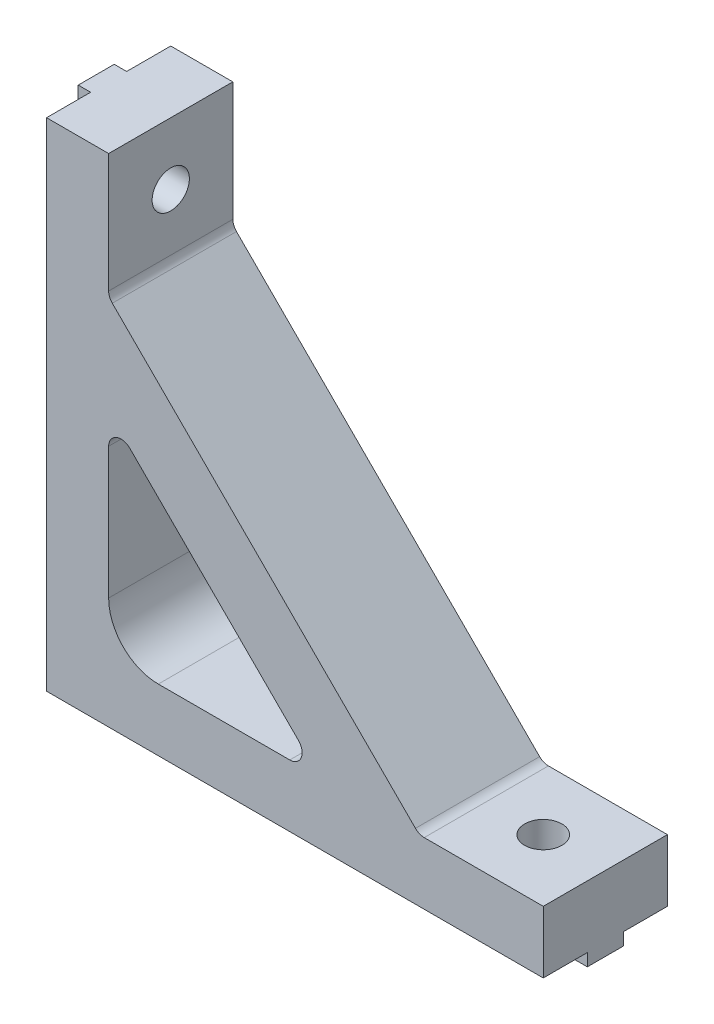
ISO-10303-21;
HEADER;
FILE_DESCRIPTION(('STEP AP214'),'2;1');
FILE_NAME('part.step','',(''),(''),'','','');
FILE_SCHEMA(('AUTOMOTIVE_DESIGN { 1 0 10303 214 1 1 1 1 }'));
ENDSEC;
DATA;
#1=APPLICATION_CONTEXT('core data for automotive mechanical design processes');
#2=APPLICATION_PROTOCOL_DEFINITION('international standard','automotive_design',2000,#1);
#3=PRODUCT_CONTEXT('',#1,'mechanical');
#4=PRODUCT('Part','Part','',(#3));
#5=PRODUCT_RELATED_PRODUCT_CATEGORY('part','',(#4));
#6=PRODUCT_DEFINITION_FORMATION('','',#4);
#7=PRODUCT_DEFINITION_CONTEXT('part definition',#1,'design');
#8=PRODUCT_DEFINITION('design','',#6,#7);
#9=PRODUCT_DEFINITION_SHAPE('','',#8);
#10=(LENGTH_UNIT() NAMED_UNIT(*) SI_UNIT(.MILLI.,.METRE.));
#11=(NAMED_UNIT(*) PLANE_ANGLE_UNIT() SI_UNIT($,.RADIAN.));
#12=(NAMED_UNIT(*) SI_UNIT($,.STERADIAN.) SOLID_ANGLE_UNIT());
#13=UNCERTAINTY_MEASURE_WITH_UNIT(LENGTH_MEASURE(1.E-05),#10,'distance_accuracy_value','');
#14=(GEOMETRIC_REPRESENTATION_CONTEXT(3) GLOBAL_UNCERTAINTY_ASSIGNED_CONTEXT((#13)) GLOBAL_UNIT_ASSIGNED_CONTEXT((#10,
#11,#12)) REPRESENTATION_CONTEXT('',''));
#15=CARTESIAN_POINT('',(0.,0.,0.));
#16=DIRECTION('',(0.,0.,1.));
#17=DIRECTION('',(1.,0.,0.));
#18=AXIS2_PLACEMENT_3D('',#15,#16,#17);
#19=CARTESIAN_POINT('',(40.,5.,10.));
#20=DIRECTION('',(0.,-1.,0.));
#21=DIRECTION('',(1.,0.,0.));
#22=AXIS2_PLACEMENT_3D('',#19,#20,#21);
#23=PLANE('',#22);
#24=CARTESIAN_POINT('',(35.,5.,5.));
#25=DIRECTION('',(0.,-1.,0.));
#26=DIRECTION('',(1.,0.,0.));
#27=AXIS2_PLACEMENT_3D('',#24,#25,#26);
#28=CIRCLE('',#27,1.5);
#29=CARTESIAN_POINT('',(36.5,5.,5.));
#30=VERTEX_POINT('',#29);
#31=EDGE_CURVE('E274',#30,#30,#28,.T.);
#32=ORIENTED_EDGE('',*,*,#31,.T.);
#33=EDGE_LOOP('',(#32));
#34=FACE_BOUND('',#33,.T.);
#35=DIRECTION('',(-1.,0.,0.));
#36=VECTOR('',#35,1.);
#37=CARTESIAN_POINT('',(40.,5.,0.));
#38=LINE('',#37,#36);
#39=CARTESIAN_POINT('',(40.,5.,0.));
#40=VERTEX_POINT('',#39);
#41=CARTESIAN_POINT('',(30.4142135623731,5.,0.));
#42=VERTEX_POINT('',#41);
#43=EDGE_CURVE('E373',#40,#42,#38,.T.);
#44=ORIENTED_EDGE('',*,*,#43,.T.);
#45=DIRECTION('',(0.,0.,1.));
#46=VECTOR('',#45,1.);
#47=CARTESIAN_POINT('',(30.4142135623731,5.,10.));
#48=LINE('',#47,#46);
#49=CARTESIAN_POINT('',(30.4142135623731,5.,10.));
#50=VERTEX_POINT('',#49);
#51=EDGE_CURVE('E429',#42,#50,#48,.T.);
#52=ORIENTED_EDGE('',*,*,#51,.T.);
#53=DIRECTION('',(-1.,0.,0.));
#54=VECTOR('',#53,1.);
#55=CARTESIAN_POINT('',(40.,5.,10.));
#56=LINE('',#55,#54);
#57=CARTESIAN_POINT('',(40.,5.,10.));
#58=VERTEX_POINT('',#57);
#59=EDGE_CURVE('E353',#58,#50,#56,.T.);
#60=ORIENTED_EDGE('',*,*,#59,.F.);
#61=DIRECTION('',(0.,0.,-1.));
#62=VECTOR('',#61,1.);
#63=CARTESIAN_POINT('',(40.,5.,10.));
#64=LINE('',#63,#62);
#65=EDGE_CURVE('E395',#58,#40,#64,.T.);
#66=ORIENTED_EDGE('',*,*,#65,.T.);
#67=EDGE_LOOP('',(#44,#52,#60,#66));
#68=FACE_BOUND('',#67,.T.);
#69=ADVANCED_FACE('F33',(#34,#68),#23,.F.);
#70=CARTESIAN_POINT('',(5.,9.,10.));
#71=DIRECTION('',(-1.,0.,0.));
#72=DIRECTION('',(0.,-1.,0.));
#73=AXIS2_PLACEMENT_3D('',#70,#71,#72);
#74=PLANE('',#73);
#75=CARTESIAN_POINT('',(5.,35.,5.));
#76=DIRECTION('',(-1.,0.,0.));
#77=DIRECTION('',(0.,-1.,0.));
#78=AXIS2_PLACEMENT_3D('',#75,#76,#77);
#79=CIRCLE('',#78,1.5);
#80=CARTESIAN_POINT('',(5.,33.5,5.));
#81=VERTEX_POINT('',#80);
#82=EDGE_CURVE('E308',#81,#81,#79,.T.);
#83=ORIENTED_EDGE('',*,*,#82,.T.);
#84=EDGE_LOOP('',(#83));
#85=FACE_BOUND('',#84,.T.);
#86=DIRECTION('',(0.,1.,0.));
#87=VECTOR('',#86,1.);
#88=CARTESIAN_POINT('',(5.,9.,10.));
#89=LINE('',#88,#87);
#90=CARTESIAN_POINT('',(5.,30.4142135623731,10.));
#91=VERTEX_POINT('',#90);
#92=CARTESIAN_POINT('',(5.,40.,10.));
#93=VERTEX_POINT('',#92);
#94=EDGE_CURVE('E358',#91,#93,#89,.T.);
#95=ORIENTED_EDGE('',*,*,#94,.F.);
#96=DIRECTION('',(0.,0.,1.));
#97=VECTOR('',#96,1.);
#98=CARTESIAN_POINT('',(5.,30.4142135623731,10.));
#99=LINE('',#98,#97);
#100=CARTESIAN_POINT('',(5.,30.4142135623731,0.));
#101=VERTEX_POINT('',#100);
#102=EDGE_CURVE('E427',#91,#101,#99,.F.);
#103=ORIENTED_EDGE('',*,*,#102,.T.);
#104=DIRECTION('',(0.,1.,0.));
#105=VECTOR('',#104,1.);
#106=CARTESIAN_POINT('',(5.,9.,0.));
#107=LINE('',#106,#105);
#108=CARTESIAN_POINT('',(5.,40.,0.));
#109=VERTEX_POINT('',#108);
#110=EDGE_CURVE('E377',#101,#109,#107,.T.);
#111=ORIENTED_EDGE('',*,*,#110,.T.);
#112=DIRECTION('',(0.,0.,-1.));
#113=VECTOR('',#112,1.);
#114=CARTESIAN_POINT('',(5.,40.,10.));
#115=LINE('',#114,#113);
#116=EDGE_CURVE('E386',#93,#109,#115,.T.);
#117=ORIENTED_EDGE('',*,*,#116,.F.);
#118=EDGE_LOOP('',(#95,#103,#111,#117));
#119=FACE_BOUND('',#118,.T.);
#120=ADVANCED_FACE('F530',(#85,#119),#74,.F.);
#121=CARTESIAN_POINT('',(0.,-1.,3.55));
#122=DIRECTION('',(0.,0.,1.));
#123=DIRECTION('',(1.,0.,0.));
#124=AXIS2_PLACEMENT_3D('',#121,#122,#123);
#125=PLANE('',#124);
#126=DIRECTION('',(1.,0.,0.));
#127=VECTOR('',#126,1.);
#128=CARTESIAN_POINT('',(0.,0.,3.55));
#129=LINE('',#128,#127);
#130=CARTESIAN_POINT('',(0.,0.,3.55));
#131=VERTEX_POINT('',#130);
#132=CARTESIAN_POINT('',(34.6159427126065,0.,3.55000000000001));
#133=VERTEX_POINT('',#132);
#134=EDGE_CURVE('E275',#131,#133,#129,.T.);
#135=ORIENTED_EDGE('',*,*,#134,.T.);
#136=DIRECTION('',(0.,-1.,0.));
#137=VECTOR('',#136,1.);
#138=CARTESIAN_POINT('',(34.6159427126065,40.,3.55000000000001));
#139=LINE('',#138,#137);
#140=CARTESIAN_POINT('',(34.6159427126065,-1.,3.55000000000001));
#141=VERTEX_POINT('',#140);
#142=EDGE_CURVE('E600',#133,#141,#139,.T.);
#143=ORIENTED_EDGE('',*,*,#142,.T.);
#144=DIRECTION('',(1.,0.,0.));
#145=VECTOR('',#144,1.);
#146=CARTESIAN_POINT('',(0.,-1.,3.55));
#147=LINE('',#146,#145);
#148=CARTESIAN_POINT('',(0.,-1.,3.55));
#149=VERTEX_POINT('',#148);
#150=EDGE_CURVE('E256',#149,#141,#147,.T.);
#151=ORIENTED_EDGE('',*,*,#150,.F.);
#152=DIRECTION('',(0.,1.,0.));
#153=VECTOR('',#152,1.);
#154=CARTESIAN_POINT('',(0.,-1.,3.55));
#155=LINE('',#154,#153);
#156=EDGE_CURVE('E287',#149,#131,#155,.T.);
#157=ORIENTED_EDGE('',*,*,#156,.T.);
#158=EDGE_LOOP('',(#135,#143,#151,#157));
#159=FACE_BOUND('',#158,.T.);
#160=ADVANCED_FACE('F483',(#159),#125,.F.);
#161=CARTESIAN_POINT('',(0.,-1.,6.45));
#162=DIRECTION('',(0.,0.,-1.));
#163=DIRECTION('',(-1.,0.,0.));
#164=AXIS2_PLACEMENT_3D('',#161,#162,#163);
#165=PLANE('',#164);
#166=DIRECTION('',(-1.,0.,0.));
#167=VECTOR('',#166,1.);
#168=CARTESIAN_POINT('',(0.,0.,6.45));
#169=LINE('',#168,#167);
#170=CARTESIAN_POINT('',(40.,0.,6.45));
#171=VERTEX_POINT('',#170);
#172=CARTESIAN_POINT('',(35.3840572873934,0.,6.45000000000001));
#173=VERTEX_POINT('',#172);
#174=EDGE_CURVE('E262',#171,#173,#169,.T.);
#175=ORIENTED_EDGE('',*,*,#174,.T.);
#176=DIRECTION('',(0.,-1.,0.));
#177=VECTOR('',#176,1.);
#178=CARTESIAN_POINT('',(35.3840572873934,40.,6.45000000000001));
#179=LINE('',#178,#177);
#180=CARTESIAN_POINT('',(35.3840572873934,-1.,6.45000000000001));
#181=VERTEX_POINT('',#180);
#182=EDGE_CURVE('E240',#173,#181,#179,.T.);
#183=ORIENTED_EDGE('',*,*,#182,.T.);
#184=DIRECTION('',(-1.,0.,0.));
#185=VECTOR('',#184,1.);
#186=CARTESIAN_POINT('',(0.,-1.,6.45));
#187=LINE('',#186,#185);
#188=CARTESIAN_POINT('',(40.,-1.,6.45000000000001));
#189=VERTEX_POINT('',#188);
#190=EDGE_CURVE('E248',#189,#181,#187,.T.);
#191=ORIENTED_EDGE('',*,*,#190,.F.);
#192=DIRECTION('',(0.,1.,0.));
#193=VECTOR('',#192,1.);
#194=CARTESIAN_POINT('',(40.,-1.,6.45000000000001));
#195=LINE('',#194,#193);
#196=EDGE_CURVE('E283',#189,#171,#195,.T.);
#197=ORIENTED_EDGE('',*,*,#196,.T.);
#198=EDGE_LOOP('',(#175,#183,#191,#197));
#199=FACE_BOUND('',#198,.T.);
#200=ADVANCED_FACE('F616',(#199),#165,.F.);
#201=CARTESIAN_POINT('',(0.,-1.,0.));
#202=DIRECTION('',(0.,1.,0.));
#203=DIRECTION('',(0.,0.,1.));
#204=AXIS2_PLACEMENT_3D('',#201,#202,#203);
#205=PLANE('',#204);
#206=ORIENTED_EDGE('',*,*,#190,.T.);
#207=CARTESIAN_POINT('',(35.,-1.,5.));
#208=DIRECTION('',(0.,-1.,0.));
#209=DIRECTION('',(0.,0.,-1.));
#210=AXIS2_PLACEMENT_3D('',#207,#208,#209);
#211=CIRCLE('',#210,1.5);
#212=CARTESIAN_POINT('',(35.3840572873935,-1.,3.55000000000001));
#213=VERTEX_POINT('',#212);
#214=EDGE_CURVE('E233',#213,#181,#211,.T.);
#215=ORIENTED_EDGE('',*,*,#214,.F.);
#216=CARTESIAN_POINT('',(40.,-1.,3.55000000000001));
#217=VERTEX_POINT('',#216);
#218=EDGE_CURVE('E245',#213,#217,#147,.T.);
#219=ORIENTED_EDGE('',*,*,#218,.T.);
#220=DIRECTION('',(0.,0.,1.));
#221=VECTOR('',#220,1.);
#222=CARTESIAN_POINT('',(40.,-1.,3.55000000000001));
#223=LINE('',#222,#221);
#224=EDGE_CURVE('E260',#217,#189,#223,.T.);
#225=ORIENTED_EDGE('',*,*,#224,.T.);
#226=EDGE_LOOP('',(#206,#215,#219,#225));
#227=FACE_BOUND('',#226,.T.);
#228=ADVANCED_FACE('F244',(#227),#205,.F.);
#229=CARTESIAN_POINT('',(0.,0.,10.));
#230=DIRECTION('',(0.,1.,0.));
#231=DIRECTION('',(0.,0.,1.));
#232=AXIS2_PLACEMENT_3D('',#229,#230,#231);
#233=PLANE('',#232);
#234=CARTESIAN_POINT('',(34.6159427126066,0.,6.45000000000001));
#235=VERTEX_POINT('',#234);
#236=CARTESIAN_POINT('',(0.,0.,6.45));
#237=VERTEX_POINT('',#236);
#238=EDGE_CURVE('E278',#235,#237,#169,.T.);
#239=ORIENTED_EDGE('',*,*,#238,.F.);
#240=CARTESIAN_POINT('',(35.,0.,5.));
#241=DIRECTION('',(0.,1.,0.));
#242=DIRECTION('',(0.,0.,1.));
#243=AXIS2_PLACEMENT_3D('',#240,#241,#242);
#244=CIRCLE('',#243,1.5);
#245=EDGE_CURVE('E497',#235,#173,#244,.T.);
#246=ORIENTED_EDGE('',*,*,#245,.T.);
#247=ORIENTED_EDGE('',*,*,#174,.F.);
#248=DIRECTION('',(0.,0.,-1.));
#249=VECTOR('',#248,1.);
#250=CARTESIAN_POINT('',(40.,0.,10.));
#251=LINE('',#250,#249);
#252=CARTESIAN_POINT('',(40.,0.,10.));
#253=VERTEX_POINT('',#252);
#254=EDGE_CURVE('E399',#253,#171,#251,.T.);
#255=ORIENTED_EDGE('',*,*,#254,.F.);
#256=DIRECTION('',(1.,0.,0.));
#257=VECTOR('',#256,1.);
#258=CARTESIAN_POINT('',(0.,0.,10.));
#259=LINE('',#258,#257);
#260=CARTESIAN_POINT('',(0.,0.,10.));
#261=VERTEX_POINT('',#260);
#262=EDGE_CURVE('E347',#261,#253,#259,.T.);
#263=ORIENTED_EDGE('',*,*,#262,.F.);
#264=DIRECTION('',(0.,0.,-1.));
#265=VECTOR('',#264,1.);
#266=CARTESIAN_POINT('',(0.,0.,10.));
#267=LINE('',#266,#265);
#268=EDGE_CURVE('E403',#261,#237,#267,.T.);
#269=ORIENTED_EDGE('',*,*,#268,.T.);
#270=EDGE_LOOP('',(#239,#246,#247,#255,#263,#269));
#271=FACE_BOUND('',#270,.T.);
#272=ADVANCED_FACE('F496',(#271),#233,.F.);
#273=DIRECTION('',(0.,0.,-1.));
#274=VECTOR('',#273,1.);
#275=CARTESIAN_POINT('',(0.,0.,3.55));
#276=LINE('',#275,#274);
#277=EDGE_CURVE('E270',#237,#131,#276,.T.);
#278=ORIENTED_EDGE('',*,*,#277,.F.);
#279=DIRECTION('',(1.,0.,0.));
#280=VECTOR('',#279,1.);
#281=CARTESIAN_POINT('',(-1.,0.,6.45000000000001));
#282=LINE('',#281,#280);
#283=CARTESIAN_POINT('',(-1.,0.,6.45000000000001));
#284=VERTEX_POINT('',#283);
#285=EDGE_CURVE('E337',#284,#237,#282,.T.);
#286=ORIENTED_EDGE('',*,*,#285,.F.);
#287=DIRECTION('',(0.,0.,1.));
#288=VECTOR('',#287,1.);
#289=CARTESIAN_POINT('',(-1.,0.,3.55));
#290=LINE('',#289,#288);
#291=CARTESIAN_POINT('',(-1.,0.,3.55));
#292=VERTEX_POINT('',#291);
#293=EDGE_CURVE('E315',#292,#284,#290,.T.);
#294=ORIENTED_EDGE('',*,*,#293,.F.);
#295=DIRECTION('',(1.,0.,0.));
#296=VECTOR('',#295,1.);
#297=CARTESIAN_POINT('',(-1.,0.,3.55));
#298=LINE('',#297,#296);
#299=EDGE_CURVE('E340',#292,#131,#298,.T.);
#300=ORIENTED_EDGE('',*,*,#299,.T.);
#301=EDGE_LOOP('',(#278,#286,#294,#300));
#302=FACE_BOUND('',#301,.T.);
#303=ADVANCED_FACE('F476',(#302),#233,.F.);
#304=CARTESIAN_POINT('',(35.3840572873935,0.,3.55000000000001));
#305=VERTEX_POINT('',#304);
#306=CARTESIAN_POINT('',(40.,0.,3.55000000000001));
#307=VERTEX_POINT('',#306);
#308=EDGE_CURVE('E273',#305,#307,#129,.T.);
#309=ORIENTED_EDGE('',*,*,#308,.F.);
#310=CARTESIAN_POINT('',(35.,0.,5.));
#311=DIRECTION('',(0.,1.,0.));
#312=DIRECTION('',(0.,0.,1.));
#313=AXIS2_PLACEMENT_3D('',#310,#311,#312);
#314=CIRCLE('',#313,1.5);
#315=EDGE_CURVE('E236',#305,#133,#314,.T.);
#316=ORIENTED_EDGE('',*,*,#315,.T.);
#317=ORIENTED_EDGE('',*,*,#134,.F.);
#318=CARTESIAN_POINT('',(0.,0.,0.));
#319=VERTEX_POINT('',#318);
#320=EDGE_CURVE('E402',#131,#319,#267,.T.);
#321=ORIENTED_EDGE('',*,*,#320,.T.);
#322=DIRECTION('',(1.,0.,0.));
#323=VECTOR('',#322,1.);
#324=CARTESIAN_POINT('',(0.,0.,0.));
#325=LINE('',#324,#323);
#326=CARTESIAN_POINT('',(40.,0.,0.));
#327=VERTEX_POINT('',#326);
#328=EDGE_CURVE('E367',#319,#327,#325,.T.);
#329=ORIENTED_EDGE('',*,*,#328,.T.);
#330=EDGE_CURVE('E398',#307,#327,#251,.T.);
#331=ORIENTED_EDGE('',*,*,#330,.F.);
#332=EDGE_LOOP('',(#309,#316,#317,#321,#329,#331));
#333=FACE_BOUND('',#332,.T.);
#334=ADVANCED_FACE('F466',(#333),#233,.F.);
#335=CARTESIAN_POINT('',(-1.,40.,3.55));
#336=DIRECTION('',(0.,0.,1.));
#337=DIRECTION('',(0.,-1.,0.));
#338=AXIS2_PLACEMENT_3D('',#335,#336,#337);
#339=PLANE('',#338);
#340=DIRECTION('',(0.,-1.,0.));
#341=VECTOR('',#340,1.);
#342=CARTESIAN_POINT('',(0.,40.,3.55));
#343=LINE('',#342,#341);
#344=CARTESIAN_POINT('',(0.,40.,3.55));
#345=VERTEX_POINT('',#344);
#346=CARTESIAN_POINT('',(0.,35.3840572873935,3.55));
#347=VERTEX_POINT('',#346);
#348=EDGE_CURVE('E325',#345,#347,#343,.T.);
#349=ORIENTED_EDGE('',*,*,#348,.T.);
#350=DIRECTION('',(-1.,0.,0.));
#351=VECTOR('',#350,1.);
#352=CARTESIAN_POINT('',(40.,35.3840572873934,3.55));
#353=LINE('',#352,#351);
#354=CARTESIAN_POINT('',(-1.,35.3840572873935,3.55));
#355=VERTEX_POINT('',#354);
#356=EDGE_CURVE('E305',#347,#355,#353,.T.);
#357=ORIENTED_EDGE('',*,*,#356,.T.);
#358=DIRECTION('',(0.,-1.,0.));
#359=VECTOR('',#358,1.);
#360=CARTESIAN_POINT('',(-1.,40.,3.55));
#361=LINE('',#360,#359);
#362=CARTESIAN_POINT('',(-1.,40.,3.55));
#363=VERTEX_POINT('',#362);
#364=EDGE_CURVE('E312',#363,#355,#361,.T.);
#365=ORIENTED_EDGE('',*,*,#364,.F.);
#366=DIRECTION('',(1.,0.,0.));
#367=VECTOR('',#366,1.);
#368=CARTESIAN_POINT('',(-1.,40.,3.55));
#369=LINE('',#368,#367);
#370=EDGE_CURVE('E324',#363,#345,#369,.T.);
#371=ORIENTED_EDGE('',*,*,#370,.T.);
#372=EDGE_LOOP('',(#349,#357,#365,#371));
#373=FACE_BOUND('',#372,.T.);
#374=ADVANCED_FACE('F514',(#373),#339,.F.);
#375=CARTESIAN_POINT('',(-1.,40.,6.45));
#376=DIRECTION('',(0.,0.,-1.));
#377=DIRECTION('',(0.,1.,0.));
#378=AXIS2_PLACEMENT_3D('',#375,#376,#377);
#379=PLANE('',#378);
#380=DIRECTION('',(0.,1.,0.));
#381=VECTOR('',#380,1.);
#382=CARTESIAN_POINT('',(0.,40.,6.45));
#383=LINE('',#382,#381);
#384=CARTESIAN_POINT('',(0.,34.6159427126066,6.45));
#385=VERTEX_POINT('',#384);
#386=EDGE_CURVE('E329',#237,#385,#383,.T.);
#387=ORIENTED_EDGE('',*,*,#386,.T.);
#388=DIRECTION('',(-1.,0.,0.));
#389=VECTOR('',#388,1.);
#390=CARTESIAN_POINT('',(40.,34.6159427126066,6.45));
#391=LINE('',#390,#389);
#392=CARTESIAN_POINT('',(-1.,34.6159427126066,6.45));
#393=VERTEX_POINT('',#392);
#394=EDGE_CURVE('E296',#385,#393,#391,.T.);
#395=ORIENTED_EDGE('',*,*,#394,.T.);
#396=DIRECTION('',(0.,1.,0.));
#397=VECTOR('',#396,1.);
#398=CARTESIAN_POINT('',(-1.,40.,6.45));
#399=LINE('',#398,#397);
#400=EDGE_CURVE('E319',#284,#393,#399,.T.);
#401=ORIENTED_EDGE('',*,*,#400,.F.);
#402=ORIENTED_EDGE('',*,*,#285,.T.);
#403=EDGE_LOOP('',(#387,#395,#401,#402));
#404=FACE_BOUND('',#403,.T.);
#405=ADVANCED_FACE('F504',(#404),#379,.F.);
#406=CARTESIAN_POINT('',(-1.,0.,0.));
#407=DIRECTION('',(-1.,0.,0.));
#408=DIRECTION('',(0.,-1.,0.));
#409=AXIS2_PLACEMENT_3D('',#406,#407,#408);
#410=PLANE('',#409);
#411=CARTESIAN_POINT('',(-1.,35.,5.));
#412=DIRECTION('',(-1.,0.,0.));
#413=DIRECTION('',(0.,-1.,0.));
#414=AXIS2_PLACEMENT_3D('',#411,#412,#413);
#415=CIRCLE('',#414,1.5);
#416=CARTESIAN_POINT('',(-1.,35.3840572873934,6.45));
#417=VERTEX_POINT('',#416);
#418=EDGE_CURVE('E408',#417,#355,#415,.T.);
#419=ORIENTED_EDGE('',*,*,#418,.F.);
#420=CARTESIAN_POINT('',(-1.,40.,6.45));
#421=VERTEX_POINT('',#420);
#422=EDGE_CURVE('E318',#417,#421,#399,.T.);
#423=ORIENTED_EDGE('',*,*,#422,.T.);
#424=DIRECTION('',(0.,0.,-1.));
#425=VECTOR('',#424,1.);
#426=CARTESIAN_POINT('',(-1.,40.,3.55));
#427=LINE('',#426,#425);
#428=EDGE_CURVE('E322',#421,#363,#427,.T.);
#429=ORIENTED_EDGE('',*,*,#428,.T.);
#430=ORIENTED_EDGE('',*,*,#364,.T.);
#431=EDGE_LOOP('',(#419,#423,#429,#430));
#432=FACE_BOUND('',#431,.T.);
#433=ADVANCED_FACE('F540',(#432),#410,.T.);
#434=CARTESIAN_POINT('',(0.,40.,10.));
#435=DIRECTION('',(1.,0.,0.));
#436=DIRECTION('',(0.,1.,0.));
#437=AXIS2_PLACEMENT_3D('',#434,#435,#436);
#438=PLANE('',#437);
#439=CARTESIAN_POINT('',(0.,34.6159427126065,3.55));
#440=VERTEX_POINT('',#439);
#441=EDGE_CURVE('E311',#440,#131,#343,.T.);
#442=ORIENTED_EDGE('',*,*,#441,.F.);
#443=CARTESIAN_POINT('',(0.,35.,5.));
#444=DIRECTION('',(1.,0.,0.));
#445=DIRECTION('',(0.,1.,0.));
#446=AXIS2_PLACEMENT_3D('',#443,#444,#445);
#447=CIRCLE('',#446,1.5);
#448=EDGE_CURVE('E302',#440,#347,#447,.T.);
#449=ORIENTED_EDGE('',*,*,#448,.T.);
#450=ORIENTED_EDGE('',*,*,#348,.F.);
#451=DIRECTION('',(0.,0.,-1.));
#452=VECTOR('',#451,1.);
#453=CARTESIAN_POINT('',(0.,40.,10.));
#454=LINE('',#453,#452);
#455=CARTESIAN_POINT('',(0.,40.,0.));
#456=VERTEX_POINT('',#455);
#457=EDGE_CURVE('E364',#345,#456,#454,.T.);
#458=ORIENTED_EDGE('',*,*,#457,.T.);
#459=DIRECTION('',(0.,-1.,0.));
#460=VECTOR('',#459,1.);
#461=CARTESIAN_POINT('',(0.,40.,0.));
#462=LINE('',#461,#460);
#463=EDGE_CURVE('E343',#456,#319,#462,.T.);
#464=ORIENTED_EDGE('',*,*,#463,.T.);
#465=ORIENTED_EDGE('',*,*,#320,.F.);
#466=EDGE_LOOP('',(#442,#449,#450,#458,#464,#465));
#467=FACE_BOUND('',#466,.T.);
#468=ADVANCED_FACE('F471',(#467),#438,.F.);
#469=CARTESIAN_POINT('',(0.,35.3840572873934,6.45));
#470=VERTEX_POINT('',#469);
#471=CARTESIAN_POINT('',(0.,40.,6.45));
#472=VERTEX_POINT('',#471);
#473=EDGE_CURVE('E328',#470,#472,#383,.T.);
#474=ORIENTED_EDGE('',*,*,#473,.F.);
#475=CARTESIAN_POINT('',(0.,35.,5.));
#476=DIRECTION('',(1.,0.,0.));
#477=DIRECTION('',(0.,1.,0.));
#478=AXIS2_PLACEMENT_3D('',#475,#476,#477);
#479=CIRCLE('',#478,1.5);
#480=EDGE_CURVE('E293',#470,#385,#479,.T.);
#481=ORIENTED_EDGE('',*,*,#480,.T.);
#482=ORIENTED_EDGE('',*,*,#386,.F.);
#483=ORIENTED_EDGE('',*,*,#268,.F.);
#484=DIRECTION('',(0.,-1.,0.));
#485=VECTOR('',#484,1.);
#486=CARTESIAN_POINT('',(0.,40.,10.));
#487=LINE('',#486,#485);
#488=CARTESIAN_POINT('',(0.,40.,10.));
#489=VERTEX_POINT('',#488);
#490=EDGE_CURVE('E344',#489,#261,#487,.T.);
#491=ORIENTED_EDGE('',*,*,#490,.F.);
#492=EDGE_CURVE('E383',#489,#472,#454,.T.);
#493=ORIENTED_EDGE('',*,*,#492,.T.);
#494=EDGE_LOOP('',(#474,#481,#482,#483,#491,#493));
#495=FACE_BOUND('',#494,.T.);
#496=ADVANCED_FACE('F533',(#495),#438,.F.);
#497=CARTESIAN_POINT('',(40.,0.,10.));
#498=DIRECTION('',(-1.,0.,0.));
#499=DIRECTION('',(0.,0.,1.));
#500=AXIS2_PLACEMENT_3D('',#497,#498,#499);
#501=PLANE('',#500);
#502=DIRECTION('',(0.,1.,0.));
#503=VECTOR('',#502,1.);
#504=CARTESIAN_POINT('',(40.,0.,0.));
#505=LINE('',#504,#503);
#506=EDGE_CURVE('E370',#327,#40,#505,.T.);
#507=ORIENTED_EDGE('',*,*,#506,.T.);
#508=ORIENTED_EDGE('',*,*,#65,.F.);
#509=DIRECTION('',(0.,1.,0.));
#510=VECTOR('',#509,1.);
#511=CARTESIAN_POINT('',(40.,0.,10.));
#512=LINE('',#511,#510);
#513=EDGE_CURVE('E350',#253,#58,#512,.T.);
#514=ORIENTED_EDGE('',*,*,#513,.F.);
#515=ORIENTED_EDGE('',*,*,#254,.T.);
#516=ORIENTED_EDGE('',*,*,#196,.F.);
#517=ORIENTED_EDGE('',*,*,#224,.F.);
#518=DIRECTION('',(0.,1.,0.));
#519=VECTOR('',#518,1.);
#520=CARTESIAN_POINT('',(40.,-1.,3.55000000000001));
#521=LINE('',#520,#519);
#522=EDGE_CURVE('E254',#217,#307,#521,.T.);
#523=ORIENTED_EDGE('',*,*,#522,.T.);
#524=ORIENTED_EDGE('',*,*,#330,.T.);
#525=EDGE_LOOP('',(#507,#508,#514,#515,#516,#517,#523,#524));
#526=FACE_BOUND('',#525,.T.);
#527=ADVANCED_FACE('F462',(#526),#501,.F.);
#528=CARTESIAN_POINT('',(19.5857864376269,5.,10.));
#529=VERTEX_POINT('',#528);
#530=CARTESIAN_POINT('',(9.,5.,10.));
#531=VERTEX_POINT('',#530);
#532=EDGE_CURVE('E352',#529,#531,#56,.T.);
#533=ORIENTED_EDGE('',*,*,#532,.F.);
#534=DIRECTION('',(0.,0.,1.));
#535=VECTOR('',#534,1.);
#536=CARTESIAN_POINT('',(19.5857864376269,5.,10.));
#537=LINE('',#536,#535);
#538=CARTESIAN_POINT('',(19.5857864376269,5.,0.));
#539=VERTEX_POINT('',#538);
#540=EDGE_CURVE('E420',#529,#539,#537,.F.);
#541=ORIENTED_EDGE('',*,*,#540,.T.);
#542=CARTESIAN_POINT('',(9.,5.,0.));
#543=VERTEX_POINT('',#542);
#544=EDGE_CURVE('E372',#539,#543,#38,.T.);
#545=ORIENTED_EDGE('',*,*,#544,.T.);
#546=DIRECTION('',(0.,0.,-1.));
#547=VECTOR('',#546,1.);
#548=CARTESIAN_POINT('',(9.,5.,10.));
#549=LINE('',#548,#547);
#550=EDGE_CURVE('E392',#531,#543,#549,.T.);
#551=ORIENTED_EDGE('',*,*,#550,.F.);
#552=EDGE_LOOP('',(#533,#541,#545,#551));
#553=FACE_BOUND('',#552,.T.);
#554=ADVANCED_FACE('F554',(#553),#23,.F.);
#555=CARTESIAN_POINT('',(9.,9.,10.));
#556=DIRECTION('',(0.,0.,-1.));
#557=DIRECTION('',(-1.,0.,0.));
#558=AXIS2_PLACEMENT_3D('',#555,#556,#557);
#559=CYLINDRICAL_SURFACE('',#558,4.);
#560=CARTESIAN_POINT('',(9.,9.,0.));
#561=DIRECTION('',(0.,0.,-1.));
#562=DIRECTION('',(-1.,0.,0.));
#563=AXIS2_PLACEMENT_3D('',#560,#561,#562);
#564=CIRCLE('',#563,4.);
#565=CARTESIAN_POINT('',(5.,9.,0.));
#566=VERTEX_POINT('',#565);
#567=EDGE_CURVE('E375',#543,#566,#564,.T.);
#568=ORIENTED_EDGE('',*,*,#567,.T.);
#569=DIRECTION('',(0.,0.,-1.));
#570=VECTOR('',#569,1.);
#571=CARTESIAN_POINT('',(5.,9.,10.));
#572=LINE('',#571,#570);
#573=CARTESIAN_POINT('',(5.,9.,10.));
#574=VERTEX_POINT('',#573);
#575=EDGE_CURVE('E389',#574,#566,#572,.T.);
#576=ORIENTED_EDGE('',*,*,#575,.F.);
#577=CARTESIAN_POINT('',(9.,9.,10.));
#578=DIRECTION('',(0.,0.,-1.));
#579=DIRECTION('',(-1.,0.,0.));
#580=AXIS2_PLACEMENT_3D('',#577,#578,#579);
#581=CIRCLE('',#580,4.);
#582=EDGE_CURVE('E356',#531,#574,#581,.T.);
#583=ORIENTED_EDGE('',*,*,#582,.F.);
#584=ORIENTED_EDGE('',*,*,#550,.T.);
#585=EDGE_LOOP('',(#568,#576,#583,#584));
#586=FACE_BOUND('',#585,.T.);
#587=ADVANCED_FACE('F565',(#586),#559,.F.);
#588=CARTESIAN_POINT('',(5.,19.5857864376269,0.));
#589=VERTEX_POINT('',#588);
#590=EDGE_CURVE('E378',#566,#589,#107,.T.);
#591=ORIENTED_EDGE('',*,*,#590,.T.);
#592=DIRECTION('',(0.,0.,1.));
#593=VECTOR('',#592,1.);
#594=CARTESIAN_POINT('',(5.,19.5857864376269,10.));
#595=LINE('',#594,#593);
#596=CARTESIAN_POINT('',(5.,19.5857864376269,10.));
#597=VERTEX_POINT('',#596);
#598=EDGE_CURVE('E412',#589,#597,#595,.T.);
#599=ORIENTED_EDGE('',*,*,#598,.T.);
#600=EDGE_CURVE('E359',#574,#597,#89,.T.);
#601=ORIENTED_EDGE('',*,*,#600,.F.);
#602=ORIENTED_EDGE('',*,*,#575,.T.);
#603=EDGE_LOOP('',(#591,#599,#601,#602));
#604=FACE_BOUND('',#603,.T.);
#605=ADVANCED_FACE('F560',(#604),#74,.F.);
#606=CARTESIAN_POINT('',(5.,40.,10.));
#607=DIRECTION('',(0.,-1.,0.));
#608=DIRECTION('',(0.,0.,-1.));
#609=AXIS2_PLACEMENT_3D('',#606,#607,#608);
#610=PLANE('',#609);
#611=DIRECTION('',(-1.,0.,0.));
#612=VECTOR('',#611,1.);
#613=CARTESIAN_POINT('',(5.,40.,0.));
#614=LINE('',#613,#612);
#615=EDGE_CURVE('E348',#109,#456,#614,.T.);
#616=ORIENTED_EDGE('',*,*,#615,.T.);
#617=ORIENTED_EDGE('',*,*,#457,.F.);
#618=ORIENTED_EDGE('',*,*,#370,.F.);
#619=ORIENTED_EDGE('',*,*,#428,.F.);
#620=DIRECTION('',(1.,0.,0.));
#621=VECTOR('',#620,1.);
#622=CARTESIAN_POINT('',(-1.,40.,6.45));
#623=LINE('',#622,#621);
#624=EDGE_CURVE('E334',#421,#472,#623,.T.);
#625=ORIENTED_EDGE('',*,*,#624,.T.);
#626=ORIENTED_EDGE('',*,*,#492,.F.);
#627=DIRECTION('',(-1.,0.,0.));
#628=VECTOR('',#627,1.);
#629=CARTESIAN_POINT('',(5.,40.,10.));
#630=LINE('',#629,#628);
#631=EDGE_CURVE('E362',#93,#489,#630,.T.);
#632=ORIENTED_EDGE('',*,*,#631,.F.);
#633=ORIENTED_EDGE('',*,*,#116,.T.);
#634=EDGE_LOOP('',(#616,#617,#618,#619,#625,#626,#632,#633));
#635=FACE_BOUND('',#634,.T.);
#636=ADVANCED_FACE('F519',(#635),#610,.F.);
#637=CARTESIAN_POINT('',(9.,9.,10.));
#638=DIRECTION('',(0.,0.,-1.));
#639=DIRECTION('',(-1.,0.,0.));
#640=AXIS2_PLACEMENT_3D('',#637,#638,#639);
#641=PLANE('',#640);
#642=ORIENTED_EDGE('',*,*,#600,.T.);
#643=CARTESIAN_POINT('',(6.,19.5857864376269,10.));
#644=DIRECTION('',(0.,0.,-1.));
#645=DIRECTION('',(-1.,0.,0.));
#646=AXIS2_PLACEMENT_3D('',#643,#644,#645);
#647=CIRCLE('',#646,1.);
#648=CARTESIAN_POINT('',(6.70710678118655,20.2928932188135,10.));
#649=VERTEX_POINT('',#648);
#650=EDGE_CURVE('E431',#597,#649,#647,.T.);
#651=ORIENTED_EDGE('',*,*,#650,.T.);
#652=DIRECTION('',(0.707106781186547,-0.707106781186548,0.));
#653=VECTOR('',#652,1.);
#654=CARTESIAN_POINT('',(5.,22.,10.));
#655=LINE('',#654,#653);
#656=CARTESIAN_POINT('',(20.2928932188135,6.70710678118655,10.));
#657=VERTEX_POINT('',#656);
#658=EDGE_CURVE('E453',#649,#657,#655,.T.);
#659=ORIENTED_EDGE('',*,*,#658,.T.);
#660=CARTESIAN_POINT('',(19.5857864376269,6.,10.));
#661=DIRECTION('',(0.,0.,-1.));
#662=DIRECTION('',(-1.,0.,0.));
#663=AXIS2_PLACEMENT_3D('',#660,#661,#662);
#664=CIRCLE('',#663,1.);
#665=EDGE_CURVE('E435',#657,#529,#664,.T.);
#666=ORIENTED_EDGE('',*,*,#665,.T.);
#667=ORIENTED_EDGE('',*,*,#532,.T.);
#668=ORIENTED_EDGE('',*,*,#582,.T.);
#669=EDGE_LOOP('',(#642,#651,#659,#666,#667,#668));
#670=FACE_BOUND('',#669,.T.);
#671=ORIENTED_EDGE('',*,*,#490,.T.);
#672=ORIENTED_EDGE('',*,*,#262,.T.);
#673=ORIENTED_EDGE('',*,*,#513,.T.);
#674=ORIENTED_EDGE('',*,*,#59,.T.);
#675=CARTESIAN_POINT('',(30.4142135623731,6.,10.));
#676=DIRECTION('',(0.,0.,-1.));
#677=DIRECTION('',(-1.,0.,0.));
#678=AXIS2_PLACEMENT_3D('',#675,#676,#677);
#679=CIRCLE('',#678,1.);
#680=CARTESIAN_POINT('',(29.7071067811865,5.29289321881346,10.));
#681=VERTEX_POINT('',#680);
#682=EDGE_CURVE('E41',#50,#681,#679,.T.);
#683=ORIENTED_EDGE('',*,*,#682,.T.);
#684=DIRECTION('',(-0.707106781186547,0.707106781186548,0.));
#685=VECTOR('',#684,1.);
#686=CARTESIAN_POINT('',(5.,30.,10.));
#687=LINE('',#686,#685);
#688=CARTESIAN_POINT('',(5.29289321881345,29.7071067811865,10.));
#689=VERTEX_POINT('',#688);
#690=EDGE_CURVE('E446',#681,#689,#687,.T.);
#691=ORIENTED_EDGE('',*,*,#690,.T.);
#692=CARTESIAN_POINT('',(6.,30.4142135623731,10.));
#693=DIRECTION('',(0.,0.,-1.));
#694=DIRECTION('',(-1.,0.,0.));
#695=AXIS2_PLACEMENT_3D('',#692,#693,#694);
#696=CIRCLE('',#695,1.);
#697=EDGE_CURVE('E439',#689,#91,#696,.T.);
#698=ORIENTED_EDGE('',*,*,#697,.T.);
#699=ORIENTED_EDGE('',*,*,#94,.T.);
#700=ORIENTED_EDGE('',*,*,#631,.T.);
#701=EDGE_LOOP('',(#671,#672,#673,#674,#683,#691,#698,#699,#700));
#702=FACE_BOUND('',#701,.T.);
#703=ADVANCED_FACE('F445',(#670,#702),#641,.F.);
#704=CARTESIAN_POINT('',(9.,9.,0.));
#705=DIRECTION('',(0.,0.,-1.));
#706=DIRECTION('',(-1.,0.,0.));
#707=AXIS2_PLACEMENT_3D('',#704,#705,#706);
#708=PLANE('',#707);
#709=DIRECTION('',(0.707106781186547,-0.707106781186548,0.));
#710=VECTOR('',#709,1.);
#711=CARTESIAN_POINT('',(5.,22.,0.));
#712=LINE('',#711,#710);
#713=CARTESIAN_POINT('',(6.70710678118655,20.2928932188135,0.));
#714=VERTEX_POINT('',#713);
#715=CARTESIAN_POINT('',(20.2928932188135,6.70710678118655,0.));
#716=VERTEX_POINT('',#715);
#717=EDGE_CURVE('E452',#714,#716,#712,.T.);
#718=ORIENTED_EDGE('',*,*,#717,.F.);
#719=CARTESIAN_POINT('',(6.,19.5857864376269,0.));
#720=DIRECTION('',(0.,0.,-1.));
#721=DIRECTION('',(-1.,0.,0.));
#722=AXIS2_PLACEMENT_3D('',#719,#720,#721);
#723=CIRCLE('',#722,1.);
#724=EDGE_CURVE('E433',#714,#589,#723,.F.);
#725=ORIENTED_EDGE('',*,*,#724,.T.);
#726=ORIENTED_EDGE('',*,*,#590,.F.);
#727=ORIENTED_EDGE('',*,*,#567,.F.);
#728=ORIENTED_EDGE('',*,*,#544,.F.);
#729=CARTESIAN_POINT('',(19.5857864376269,6.,0.));
#730=DIRECTION('',(0.,0.,-1.));
#731=DIRECTION('',(-1.,0.,0.));
#732=AXIS2_PLACEMENT_3D('',#729,#730,#731);
#733=CIRCLE('',#732,1.);
#734=EDGE_CURVE('E437',#539,#716,#733,.F.);
#735=ORIENTED_EDGE('',*,*,#734,.T.);
#736=EDGE_LOOP('',(#718,#725,#726,#727,#728,#735));
#737=FACE_BOUND('',#736,.T.);
#738=ORIENTED_EDGE('',*,*,#463,.F.);
#739=ORIENTED_EDGE('',*,*,#615,.F.);
#740=ORIENTED_EDGE('',*,*,#110,.F.);
#741=CARTESIAN_POINT('',(6.,30.4142135623731,0.));
#742=DIRECTION('',(0.,0.,-1.));
#743=DIRECTION('',(-1.,0.,0.));
#744=AXIS2_PLACEMENT_3D('',#741,#742,#743);
#745=CIRCLE('',#744,1.);
#746=CARTESIAN_POINT('',(5.29289321881345,29.7071067811865,0.));
#747=VERTEX_POINT('',#746);
#748=EDGE_CURVE('E441',#101,#747,#745,.F.);
#749=ORIENTED_EDGE('',*,*,#748,.T.);
#750=DIRECTION('',(-0.707106781186547,0.707106781186548,0.));
#751=VECTOR('',#750,1.);
#752=CARTESIAN_POINT('',(5.,30.,0.));
#753=LINE('',#752,#751);
#754=CARTESIAN_POINT('',(29.7071067811865,5.29289321881346,0.));
#755=VERTEX_POINT('',#754);
#756=EDGE_CURVE('E250',#755,#747,#753,.T.);
#757=ORIENTED_EDGE('',*,*,#756,.F.);
#758=CARTESIAN_POINT('',(30.4142135623731,6.,0.));
#759=DIRECTION('',(0.,0.,-1.));
#760=DIRECTION('',(-1.,0.,0.));
#761=AXIS2_PLACEMENT_3D('',#758,#759,#760);
#762=CIRCLE('',#761,1.);
#763=EDGE_CURVE('E11',#755,#42,#762,.F.);
#764=ORIENTED_EDGE('',*,*,#763,.T.);
#765=ORIENTED_EDGE('',*,*,#43,.F.);
#766=ORIENTED_EDGE('',*,*,#506,.F.);
#767=ORIENTED_EDGE('',*,*,#328,.F.);
#768=EDGE_LOOP('',(#738,#739,#740,#749,#757,#764,#765,#766,#767));
#769=FACE_BOUND('',#768,.T.);
#770=ADVANCED_FACE('F459',(#737,#769),#708,.T.);
#771=CARTESIAN_POINT('',(-1.,34.6159427126065,3.55));
#772=VERTEX_POINT('',#771);
#773=EDGE_CURVE('E316',#772,#292,#361,.T.);
#774=ORIENTED_EDGE('',*,*,#773,.F.);
#775=DIRECTION('',(-1.,0.,0.));
#776=VECTOR('',#775,1.);
#777=CARTESIAN_POINT('',(40.,34.6159427126065,3.55));
#778=LINE('',#777,#776);
#779=EDGE_CURVE('E299',#772,#440,#778,.F.);
#780=ORIENTED_EDGE('',*,*,#779,.T.);
#781=ORIENTED_EDGE('',*,*,#441,.T.);
#782=ORIENTED_EDGE('',*,*,#299,.F.);
#783=EDGE_LOOP('',(#774,#780,#781,#782));
#784=FACE_BOUND('',#783,.T.);
#785=ADVANCED_FACE('F508',(#784),#339,.F.);
#786=ORIENTED_EDGE('',*,*,#422,.F.);
#787=DIRECTION('',(-1.,0.,0.));
#788=VECTOR('',#787,1.);
#789=CARTESIAN_POINT('',(40.,35.3840572873934,6.45));
#790=LINE('',#789,#788);
#791=EDGE_CURVE('E290',#417,#470,#790,.F.);
#792=ORIENTED_EDGE('',*,*,#791,.T.);
#793=ORIENTED_EDGE('',*,*,#473,.T.);
#794=ORIENTED_EDGE('',*,*,#624,.F.);
#795=EDGE_LOOP('',(#786,#792,#793,#794));
#796=FACE_BOUND('',#795,.T.);
#797=ADVANCED_FACE('F537',(#796),#379,.F.);
#798=EDGE_CURVE('E406',#772,#393,#415,.T.);
#799=ORIENTED_EDGE('',*,*,#798,.F.);
#800=ORIENTED_EDGE('',*,*,#773,.T.);
#801=ORIENTED_EDGE('',*,*,#293,.T.);
#802=ORIENTED_EDGE('',*,*,#400,.T.);
#803=EDGE_LOOP('',(#799,#800,#801,#802));
#804=FACE_BOUND('',#803,.T.);
#805=ADVANCED_FACE('F507',(#804),#410,.T.);
#806=CARTESIAN_POINT('',(40.,35.,5.));
#807=DIRECTION('',(-1.,0.,0.));
#808=DIRECTION('',(0.,-1.,0.));
#809=AXIS2_PLACEMENT_3D('',#806,#807,#808);
#810=CYLINDRICAL_SURFACE('',#809,1.5);
#811=ORIENTED_EDGE('',*,*,#448,.F.);
#812=ORIENTED_EDGE('',*,*,#779,.F.);
#813=ORIENTED_EDGE('',*,*,#798,.T.);
#814=ORIENTED_EDGE('',*,*,#394,.F.);
#815=ORIENTED_EDGE('',*,*,#480,.F.);
#816=ORIENTED_EDGE('',*,*,#791,.F.);
#817=ORIENTED_EDGE('',*,*,#418,.T.);
#818=ORIENTED_EDGE('',*,*,#356,.F.);
#819=EDGE_LOOP('',(#811,#812,#813,#814,#815,#816,#817,#818));
#820=FACE_BOUND('',#819,.T.);
#821=ORIENTED_EDGE('',*,*,#82,.F.);
#822=EDGE_LOOP('',(#821));
#823=FACE_BOUND('',#822,.T.);
#824=ADVANCED_FACE('F510',(#820,#823),#810,.F.);
#825=CARTESIAN_POINT('',(0.,-1.,3.55));
#826=DIRECTION('',(1.,0.,0.));
#827=DIRECTION('',(0.,0.,-1.));
#828=AXIS2_PLACEMENT_3D('',#825,#826,#827);
#829=PLANE('',#828);
#830=ORIENTED_EDGE('',*,*,#277,.T.);
#831=ORIENTED_EDGE('',*,*,#156,.F.);
#832=DIRECTION('',(0.,0.,-1.));
#833=VECTOR('',#832,1.);
#834=CARTESIAN_POINT('',(0.,-1.,3.55));
#835=LINE('',#834,#833);
#836=CARTESIAN_POINT('',(0.,-1.,6.45));
#837=VERTEX_POINT('',#836);
#838=EDGE_CURVE('E257',#837,#149,#835,.T.);
#839=ORIENTED_EDGE('',*,*,#838,.F.);
#840=DIRECTION('',(0.,1.,0.));
#841=VECTOR('',#840,1.);
#842=CARTESIAN_POINT('',(0.,-1.,6.45));
#843=LINE('',#842,#841);
#844=EDGE_CURVE('E269',#837,#237,#843,.T.);
#845=ORIENTED_EDGE('',*,*,#844,.T.);
#846=EDGE_LOOP('',(#830,#831,#839,#845));
#847=FACE_BOUND('',#846,.T.);
#848=ADVANCED_FACE('F487',(#847),#829,.F.);
#849=ORIENTED_EDGE('',*,*,#218,.F.);
#850=DIRECTION('',(0.,-1.,0.));
#851=VECTOR('',#850,1.);
#852=CARTESIAN_POINT('',(35.3840572873935,40.,3.55000000000001));
#853=LINE('',#852,#851);
#854=EDGE_CURVE('E229',#213,#305,#853,.F.);
#855=ORIENTED_EDGE('',*,*,#854,.T.);
#856=ORIENTED_EDGE('',*,*,#308,.T.);
#857=ORIENTED_EDGE('',*,*,#522,.F.);
#858=EDGE_LOOP('',(#849,#855,#856,#857));
#859=FACE_BOUND('',#858,.T.);
#860=ADVANCED_FACE('F252',(#859),#125,.F.);
#861=CARTESIAN_POINT('',(34.6159427126066,-1.,6.45000000000001));
#862=VERTEX_POINT('',#861);
#863=EDGE_CURVE('E267',#862,#837,#187,.T.);
#864=ORIENTED_EDGE('',*,*,#863,.F.);
#865=DIRECTION('',(0.,-1.,0.));
#866=VECTOR('',#865,1.);
#867=CARTESIAN_POINT('',(34.6159427126066,40.,6.45000000000001));
#868=LINE('',#867,#866);
#869=EDGE_CURVE('E249',#862,#235,#868,.F.);
#870=ORIENTED_EDGE('',*,*,#869,.T.);
#871=ORIENTED_EDGE('',*,*,#238,.T.);
#872=ORIENTED_EDGE('',*,*,#844,.F.);
#873=EDGE_LOOP('',(#864,#870,#871,#872));
#874=FACE_BOUND('',#873,.T.);
#875=ADVANCED_FACE('F491',(#874),#165,.F.);
#876=ORIENTED_EDGE('',*,*,#150,.T.);
#877=CARTESIAN_POINT('',(35.,-1.,5.));
#878=DIRECTION('',(0.,1.,0.));
#879=DIRECTION('',(0.,0.,1.));
#880=AXIS2_PLACEMENT_3D('',#877,#878,#879);
#881=CIRCLE('',#880,1.5);
#882=EDGE_CURVE('E409',#141,#862,#881,.T.);
#883=ORIENTED_EDGE('',*,*,#882,.T.);
#884=ORIENTED_EDGE('',*,*,#863,.T.);
#885=ORIENTED_EDGE('',*,*,#838,.T.);
#886=EDGE_LOOP('',(#876,#883,#884,#885));
#887=FACE_BOUND('',#886,.T.);
#888=ADVANCED_FACE('F603',(#887),#205,.F.);
#889=CARTESIAN_POINT('',(35.,40.,5.));
#890=DIRECTION('',(0.,-1.,0.));
#891=DIRECTION('',(0.,0.,-1.));
#892=AXIS2_PLACEMENT_3D('',#889,#890,#891);
#893=CYLINDRICAL_SURFACE('',#892,1.5);
#894=ORIENTED_EDGE('',*,*,#315,.F.);
#895=ORIENTED_EDGE('',*,*,#854,.F.);
#896=ORIENTED_EDGE('',*,*,#214,.T.);
#897=ORIENTED_EDGE('',*,*,#182,.F.);
#898=ORIENTED_EDGE('',*,*,#245,.F.);
#899=ORIENTED_EDGE('',*,*,#869,.F.);
#900=ORIENTED_EDGE('',*,*,#882,.F.);
#901=ORIENTED_EDGE('',*,*,#142,.F.);
#902=EDGE_LOOP('',(#894,#895,#896,#897,#898,#899,#900,#901));
#903=FACE_BOUND('',#902,.T.);
#904=ORIENTED_EDGE('',*,*,#31,.F.);
#905=EDGE_LOOP('',(#904));
#906=FACE_BOUND('',#905,.T.);
#907=ADVANCED_FACE('F231',(#903,#906),#893,.F.);
#908=CARTESIAN_POINT('',(5.,30.,0.));
#909=DIRECTION('',(0.707106781186548,0.707106781186547,0.));
#910=DIRECTION('',(-0.707106781186547,0.707106781186548,0.));
#911=AXIS2_PLACEMENT_3D('',#908,#909,#910);
#912=PLANE('',#911);
#913=ORIENTED_EDGE('',*,*,#756,.T.);
#914=DIRECTION('',(0.,0.,1.));
#915=VECTOR('',#914,1.);
#916=CARTESIAN_POINT('',(5.29289321881345,29.7071067811865,0.));
#917=LINE('',#916,#915);
#918=EDGE_CURVE('E424',#747,#689,#917,.T.);
#919=ORIENTED_EDGE('',*,*,#918,.T.);
#920=ORIENTED_EDGE('',*,*,#690,.F.);
#921=DIRECTION('',(0.,0.,1.));
#922=VECTOR('',#921,1.);
#923=CARTESIAN_POINT('',(29.7071067811865,5.29289321881346,0.));
#924=LINE('',#923,#922);
#925=EDGE_CURVE('E422',#681,#755,#924,.F.);
#926=ORIENTED_EDGE('',*,*,#925,.T.);
#927=EDGE_LOOP('',(#913,#919,#920,#926));
#928=FACE_BOUND('',#927,.T.);
#929=ADVANCED_FACE('F450',(#928),#912,.T.);
#930=CARTESIAN_POINT('',(5.,22.,0.));
#931=DIRECTION('',(-0.707106781186548,-0.707106781186547,0.));
#932=DIRECTION('',(0.707106781186547,-0.707106781186548,0.));
#933=AXIS2_PLACEMENT_3D('',#930,#931,#932);
#934=PLANE('',#933);
#935=ORIENTED_EDGE('',*,*,#658,.F.);
#936=DIRECTION('',(0.,0.,1.));
#937=VECTOR('',#936,1.);
#938=CARTESIAN_POINT('',(6.70710678118655,20.2928932188135,0.));
#939=LINE('',#938,#937);
#940=EDGE_CURVE('E418',#649,#714,#939,.F.);
#941=ORIENTED_EDGE('',*,*,#940,.T.);
#942=ORIENTED_EDGE('',*,*,#717,.T.);
#943=DIRECTION('',(0.,0.,1.));
#944=VECTOR('',#943,1.);
#945=CARTESIAN_POINT('',(20.2928932188135,6.70710678118655,0.));
#946=LINE('',#945,#944);
#947=EDGE_CURVE('E415',#716,#657,#946,.T.);
#948=ORIENTED_EDGE('',*,*,#947,.T.);
#949=EDGE_LOOP('',(#935,#941,#942,#948));
#950=FACE_BOUND('',#949,.T.);
#951=ADVANCED_FACE('F589',(#950),#934,.T.);
#952=CARTESIAN_POINT('',(6.,19.5857864376269,10.));
#953=DIRECTION('',(0.,0.,1.));
#954=DIRECTION('',(1.,0.,0.));
#955=AXIS2_PLACEMENT_3D('',#952,#953,#954);
#956=CYLINDRICAL_SURFACE('',#955,1.);
#957=ORIENTED_EDGE('',*,*,#724,.F.);
#958=ORIENTED_EDGE('',*,*,#940,.F.);
#959=ORIENTED_EDGE('',*,*,#650,.F.);
#960=ORIENTED_EDGE('',*,*,#598,.F.);
#961=EDGE_LOOP('',(#957,#958,#959,#960));
#962=FACE_BOUND('',#961,.T.);
#963=ADVANCED_FACE('F713',(#962),#956,.F.);
#964=CARTESIAN_POINT('',(19.5857864376269,6.,0.));
#965=DIRECTION('',(0.,0.,1.));
#966=DIRECTION('',(1.,0.,0.));
#967=AXIS2_PLACEMENT_3D('',#964,#965,#966);
#968=CYLINDRICAL_SURFACE('',#967,1.);
#969=ORIENTED_EDGE('',*,*,#734,.F.);
#970=ORIENTED_EDGE('',*,*,#540,.F.);
#971=ORIENTED_EDGE('',*,*,#665,.F.);
#972=ORIENTED_EDGE('',*,*,#947,.F.);
#973=EDGE_LOOP('',(#969,#970,#971,#972));
#974=FACE_BOUND('',#973,.T.);
#975=ADVANCED_FACE('F580',(#974),#968,.F.);
#976=CARTESIAN_POINT('',(6.,30.4142135623731,0.));
#977=DIRECTION('',(0.,0.,1.));
#978=DIRECTION('',(1.,0.,0.));
#979=AXIS2_PLACEMENT_3D('',#976,#977,#978);
#980=CYLINDRICAL_SURFACE('',#979,1.);
#981=ORIENTED_EDGE('',*,*,#748,.F.);
#982=ORIENTED_EDGE('',*,*,#102,.F.);
#983=ORIENTED_EDGE('',*,*,#697,.F.);
#984=ORIENTED_EDGE('',*,*,#918,.F.);
#985=EDGE_LOOP('',(#981,#982,#983,#984));
#986=FACE_BOUND('',#985,.T.);
#987=ADVANCED_FACE('F528',(#986),#980,.F.);
#988=CARTESIAN_POINT('',(30.4142135623731,6.,10.));
#989=DIRECTION('',(0.,0.,1.));
#990=DIRECTION('',(1.,0.,0.));
#991=AXIS2_PLACEMENT_3D('',#988,#989,#990);
#992=CYLINDRICAL_SURFACE('',#991,1.);
#993=ORIENTED_EDGE('',*,*,#763,.F.);
#994=ORIENTED_EDGE('',*,*,#925,.F.);
#995=ORIENTED_EDGE('',*,*,#682,.F.);
#996=ORIENTED_EDGE('',*,*,#51,.F.);
#997=EDGE_LOOP('',(#993,#994,#995,#996));
#998=FACE_BOUND('',#997,.T.);
#999=ADVANCED_FACE('F35',(#998),#992,.F.);
#1000=CLOSED_SHELL('',(#69,#120,#160,#200,#228,#272,#303,#334,#374,#405,#433,#468,#496,#527,
#554,#587,#605,#636,#703,#770,#785,#797,#805,#824,#848,#860,#875,#888,#907,#929,#951,#963,#975,
#987,#999));
#1001=MANIFOLD_SOLID_BREP('B2',#1000);
#1002=ADVANCED_BREP_SHAPE_REPRESENTATION('',(#18,#1001),#14);
#1003=SHAPE_DEFINITION_REPRESENTATION(#9,#1002);
ENDSEC;
END-ISO-10303-21;
